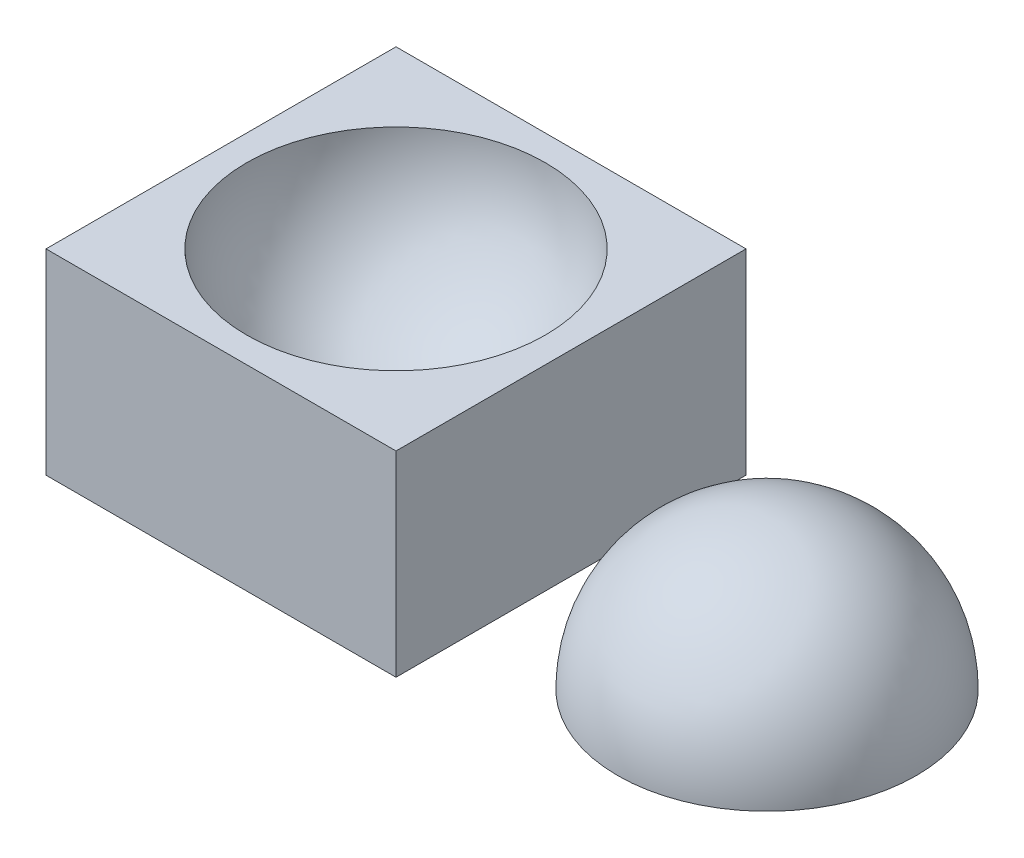
ISO-10303-21;
HEADER;
FILE_DESCRIPTION(('STEP AP214'),'2;1');
FILE_NAME('part.step','',(''),(''),'','','');
FILE_SCHEMA(('AUTOMOTIVE_DESIGN { 1 0 10303 214 1 1 1 1 }'));
ENDSEC;
DATA;
#1=APPLICATION_CONTEXT('core data for automotive mechanical design processes');
#2=APPLICATION_PROTOCOL_DEFINITION('international standard','automotive_design',2000,#1);
#3=PRODUCT_CONTEXT('',#1,'mechanical');
#4=PRODUCT('Part','Part','',(#3));
#5=PRODUCT_RELATED_PRODUCT_CATEGORY('part','',(#4));
#6=PRODUCT_DEFINITION_FORMATION('','',#4);
#7=PRODUCT_DEFINITION_CONTEXT('part definition',#1,'design');
#8=PRODUCT_DEFINITION('design','',#6,#7);
#9=PRODUCT_DEFINITION_SHAPE('','',#8);
#10=(LENGTH_UNIT() NAMED_UNIT(*) SI_UNIT(.MILLI.,.METRE.));
#11=(NAMED_UNIT(*) PLANE_ANGLE_UNIT() SI_UNIT($,.RADIAN.));
#12=(NAMED_UNIT(*) SI_UNIT($,.STERADIAN.) SOLID_ANGLE_UNIT());
#13=UNCERTAINTY_MEASURE_WITH_UNIT(LENGTH_MEASURE(1.E-05),#10,'distance_accuracy_value','');
#14=(GEOMETRIC_REPRESENTATION_CONTEXT(3) GLOBAL_UNCERTAINTY_ASSIGNED_CONTEXT((#13)) GLOBAL_UNIT_ASSIGNED_CONTEXT((#10,
#11,#12)) REPRESENTATION_CONTEXT('',''));
#15=CARTESIAN_POINT('',(0.,0.,0.));
#16=DIRECTION('',(0.,0.,1.));
#17=DIRECTION('',(1.,0.,0.));
#18=AXIS2_PLACEMENT_3D('',#15,#16,#17);
#19=CARTESIAN_POINT('',(79.5,0.,0.));
#20=DIRECTION('',(0.,-1.,0.));
#21=DIRECTION('',(-1.,0.,0.));
#22=AXIS2_PLACEMENT_3D('',#19,#20,#21);
#23=SPHERICAL_SURFACE('',#22,32.);
#24=CARTESIAN_POINT('',(79.5,0.,0.));
#25=DIRECTION('',(0.,-1.,0.));
#26=DIRECTION('',(0.,0.,-1.));
#27=AXIS2_PLACEMENT_3D('',#24,#25,#26);
#28=CIRCLE('',#27,32.);
#29=CARTESIAN_POINT('',(79.5,0.,-32.));
#30=VERTEX_POINT('',#29);
#31=EDGE_CURVE('E11',#30,#30,#28,.T.);
#32=ORIENTED_EDGE('',*,*,#31,.F.);
#33=EDGE_LOOP('',(#32));
#34=FACE_BOUND('',#33,.T.);
#35=ADVANCED_FACE('F43',(#34),#23,.T.);
#36=CARTESIAN_POINT('',(47.5,0.,0.));
#37=DIRECTION('',(0.,1.,0.));
#38=DIRECTION('',(0.,0.,1.));
#39=AXIS2_PLACEMENT_3D('',#36,#37,#38);
#40=PLANE('',#39);
#41=ORIENTED_EDGE('',*,*,#31,.T.);
#42=EDGE_LOOP('',(#41));
#43=FACE_BOUND('',#42,.T.);
#44=ADVANCED_FACE('F50',(#43),#40,.F.);
#45=CLOSED_SHELL('',(#35,#44));
#46=MANIFOLD_SOLID_BREP('B2',#45);
#47=CARTESIAN_POINT('',(0.,42.,0.));
#48=DIRECTION('',(0.,-1.,0.));
#49=DIRECTION('',(0.,0.,-1.));
#50=AXIS2_PLACEMENT_3D('',#47,#48,#49);
#51=PLANE('',#50);
#52=DIRECTION('',(0.,0.,1.));
#53=VECTOR('',#52,1.);
#54=CARTESIAN_POINT('',(-37.5,42.,37.5));
#55=LINE('',#54,#53);
#56=CARTESIAN_POINT('',(-37.5,42.,-37.5));
#57=VERTEX_POINT('',#56);
#58=CARTESIAN_POINT('',(-37.5,42.,37.5));
#59=VERTEX_POINT('',#58);
#60=EDGE_CURVE('E121',#57,#59,#55,.T.);
#61=ORIENTED_EDGE('',*,*,#60,.T.);
#62=DIRECTION('',(1.,0.,0.));
#63=VECTOR('',#62,1.);
#64=CARTESIAN_POINT('',(-37.5,42.,37.5));
#65=LINE('',#64,#63);
#66=CARTESIAN_POINT('',(37.5,42.,37.5));
#67=VERTEX_POINT('',#66);
#68=EDGE_CURVE('E116',#59,#67,#65,.T.);
#69=ORIENTED_EDGE('',*,*,#68,.T.);
#70=DIRECTION('',(0.,0.,-1.));
#71=VECTOR('',#70,1.);
#72=CARTESIAN_POINT('',(37.5,42.,37.5));
#73=LINE('',#72,#71);
#74=CARTESIAN_POINT('',(37.5,42.,-37.5));
#75=VERTEX_POINT('',#74);
#76=EDGE_CURVE('E119',#67,#75,#73,.T.);
#77=ORIENTED_EDGE('',*,*,#76,.T.);
#78=DIRECTION('',(-1.,0.,0.));
#79=VECTOR('',#78,1.);
#80=CARTESIAN_POINT('',(-37.5,42.,-37.5));
#81=LINE('',#80,#79);
#82=EDGE_CURVE('E86',#75,#57,#81,.T.);
#83=ORIENTED_EDGE('',*,*,#82,.T.);
#84=EDGE_LOOP('',(#61,#69,#77,#83));
#85=FACE_BOUND('',#84,.T.);
#86=CARTESIAN_POINT('',(0.,42.,0.));
#87=DIRECTION('',(0.,1.,0.));
#88=DIRECTION('',(0.,0.,1.));
#89=AXIS2_PLACEMENT_3D('',#86,#87,#88);
#90=CIRCLE('',#89,32.);
#91=CARTESIAN_POINT('',(0.,42.,32.));
#92=VERTEX_POINT('',#91);
#93=EDGE_CURVE('E136',#92,#92,#90,.T.);
#94=ORIENTED_EDGE('',*,*,#93,.F.);
#95=EDGE_LOOP('',(#94));
#96=FACE_BOUND('',#95,.T.);
#97=ADVANCED_FACE('F69',(#85,#96),#51,.F.);
#98=CARTESIAN_POINT('',(-37.5,42.,37.5));
#99=DIRECTION('',(1.,0.,0.));
#100=DIRECTION('',(0.,0.,-1.));
#101=AXIS2_PLACEMENT_3D('',#98,#99,#100);
#102=PLANE('',#101);
#103=DIRECTION('',(0.,0.,1.));
#104=VECTOR('',#103,1.);
#105=CARTESIAN_POINT('',(-37.5,0.,37.5));
#106=LINE('',#105,#104);
#107=CARTESIAN_POINT('',(-37.5,0.,-37.5));
#108=VERTEX_POINT('',#107);
#109=CARTESIAN_POINT('',(-37.5,0.,37.5));
#110=VERTEX_POINT('',#109);
#111=EDGE_CURVE('E133',#108,#110,#106,.T.);
#112=ORIENTED_EDGE('',*,*,#111,.T.);
#113=DIRECTION('',(0.,-1.,0.));
#114=VECTOR('',#113,1.);
#115=CARTESIAN_POINT('',(-37.5,42.,37.5));
#116=LINE('',#115,#114);
#117=EDGE_CURVE('E41',#59,#110,#116,.T.);
#118=ORIENTED_EDGE('',*,*,#117,.F.);
#119=ORIENTED_EDGE('',*,*,#60,.F.);
#120=DIRECTION('',(0.,-1.,0.));
#121=VECTOR('',#120,1.);
#122=CARTESIAN_POINT('',(-37.5,42.,-37.5));
#123=LINE('',#122,#121);
#124=EDGE_CURVE('E129',#57,#108,#123,.T.);
#125=ORIENTED_EDGE('',*,*,#124,.T.);
#126=EDGE_LOOP('',(#112,#118,#119,#125));
#127=FACE_BOUND('',#126,.T.);
#128=ADVANCED_FACE('F71',(#127),#102,.F.);
#129=CARTESIAN_POINT('',(-37.5,42.,37.5));
#130=DIRECTION('',(0.,0.,-1.));
#131=DIRECTION('',(-1.,0.,0.));
#132=AXIS2_PLACEMENT_3D('',#129,#130,#131);
#133=PLANE('',#132);
#134=DIRECTION('',(1.,0.,0.));
#135=VECTOR('',#134,1.);
#136=CARTESIAN_POINT('',(-37.5,0.,37.5));
#137=LINE('',#136,#135);
#138=CARTESIAN_POINT('',(37.5,0.,37.5));
#139=VERTEX_POINT('',#138);
#140=EDGE_CURVE('E125',#110,#139,#137,.T.);
#141=ORIENTED_EDGE('',*,*,#140,.T.);
#142=DIRECTION('',(0.,-1.,0.));
#143=VECTOR('',#142,1.);
#144=CARTESIAN_POINT('',(37.5,42.,37.5));
#145=LINE('',#144,#143);
#146=EDGE_CURVE('E78',#67,#139,#145,.T.);
#147=ORIENTED_EDGE('',*,*,#146,.F.);
#148=ORIENTED_EDGE('',*,*,#68,.F.);
#149=ORIENTED_EDGE('',*,*,#117,.T.);
#150=EDGE_LOOP('',(#141,#147,#148,#149));
#151=FACE_BOUND('',#150,.T.);
#152=ADVANCED_FACE('F124',(#151),#133,.F.);
#153=CARTESIAN_POINT('',(37.5,42.,37.5));
#154=DIRECTION('',(-1.,0.,0.));
#155=DIRECTION('',(0.,0.,1.));
#156=AXIS2_PLACEMENT_3D('',#153,#154,#155);
#157=PLANE('',#156);
#158=DIRECTION('',(0.,0.,-1.));
#159=VECTOR('',#158,1.);
#160=CARTESIAN_POINT('',(37.5,0.,37.5));
#161=LINE('',#160,#159);
#162=CARTESIAN_POINT('',(37.5,0.,-37.5));
#163=VERTEX_POINT('',#162);
#164=EDGE_CURVE('E103',#139,#163,#161,.T.);
#165=ORIENTED_EDGE('',*,*,#164,.T.);
#166=DIRECTION('',(0.,-1.,0.));
#167=VECTOR('',#166,1.);
#168=CARTESIAN_POINT('',(37.5,42.,-37.5));
#169=LINE('',#168,#167);
#170=EDGE_CURVE('E126',#75,#163,#169,.T.);
#171=ORIENTED_EDGE('',*,*,#170,.F.);
#172=ORIENTED_EDGE('',*,*,#76,.F.);
#173=ORIENTED_EDGE('',*,*,#146,.T.);
#174=EDGE_LOOP('',(#165,#171,#172,#173));
#175=FACE_BOUND('',#174,.T.);
#176=ADVANCED_FACE('F127',(#175),#157,.F.);
#177=CARTESIAN_POINT('',(-37.5,42.,-37.5));
#178=DIRECTION('',(0.,0.,1.));
#179=DIRECTION('',(1.,0.,0.));
#180=AXIS2_PLACEMENT_3D('',#177,#178,#179);
#181=PLANE('',#180);
#182=DIRECTION('',(-1.,0.,0.));
#183=VECTOR('',#182,1.);
#184=CARTESIAN_POINT('',(-37.5,0.,-37.5));
#185=LINE('',#184,#183);
#186=EDGE_CURVE('E109',#163,#108,#185,.T.);
#187=ORIENTED_EDGE('',*,*,#186,.T.);
#188=ORIENTED_EDGE('',*,*,#124,.F.);
#189=ORIENTED_EDGE('',*,*,#82,.F.);
#190=ORIENTED_EDGE('',*,*,#170,.T.);
#191=EDGE_LOOP('',(#187,#188,#189,#190));
#192=FACE_BOUND('',#191,.T.);
#193=ADVANCED_FACE('F141',(#192),#181,.F.);
#194=CARTESIAN_POINT('',(0.,0.,0.));
#195=DIRECTION('',(0.,-1.,0.));
#196=DIRECTION('',(0.,0.,-1.));
#197=AXIS2_PLACEMENT_3D('',#194,#195,#196);
#198=PLANE('',#197);
#199=ORIENTED_EDGE('',*,*,#111,.F.);
#200=ORIENTED_EDGE('',*,*,#186,.F.);
#201=ORIENTED_EDGE('',*,*,#164,.F.);
#202=ORIENTED_EDGE('',*,*,#140,.F.);
#203=EDGE_LOOP('',(#199,#200,#201,#202));
#204=FACE_BOUND('',#203,.T.);
#205=ADVANCED_FACE('F144',(#204),#198,.T.);
#206=CARTESIAN_POINT('',(0.,42.,0.));
#207=DIRECTION('',(0.,1.,0.));
#208=DIRECTION('',(0.,0.,-1.));
#209=AXIS2_PLACEMENT_3D('',#206,#207,#208);
#210=SPHERICAL_SURFACE('',#209,32.);
#211=ORIENTED_EDGE('',*,*,#93,.T.);
#212=EDGE_LOOP('',(#211));
#213=FACE_BOUND('',#212,.T.);
#214=ADVANCED_FACE('F150',(#213),#210,.F.);
#215=CLOSED_SHELL('',(#97,#128,#152,#176,#193,#205,#214));
#216=MANIFOLD_SOLID_BREP('B6',#215);
#217=ADVANCED_BREP_SHAPE_REPRESENTATION('',(#18,#46,#216),#14);
#218=SHAPE_DEFINITION_REPRESENTATION(#9,#217);
ENDSEC;
END-ISO-10303-21;
